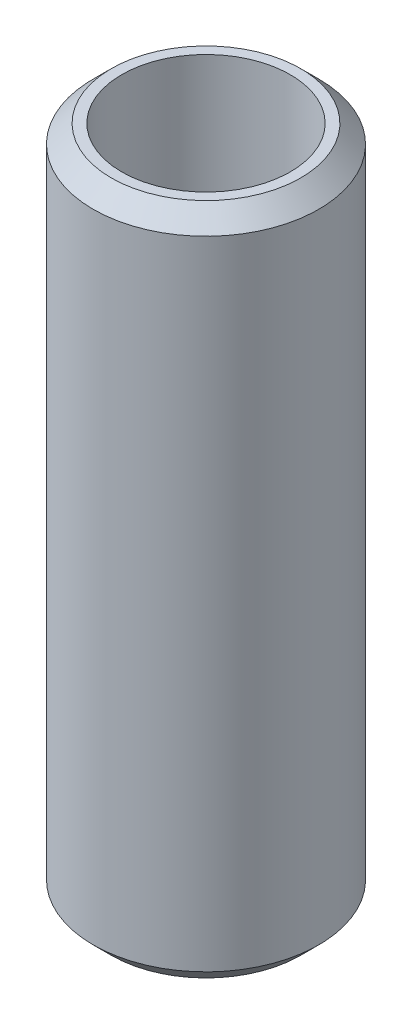
ISO-10303-21;
HEADER;
FILE_DESCRIPTION(('STEP AP214'),'2;1');
FILE_NAME('part.step','',(''),(''),'','','');
FILE_SCHEMA(('AUTOMOTIVE_DESIGN { 1 0 10303 214 1 1 1 1 }'));
ENDSEC;
DATA;
#1=APPLICATION_CONTEXT('core data for automotive mechanical design processes');
#2=APPLICATION_PROTOCOL_DEFINITION('international standard','automotive_design',2000,#1);
#3=PRODUCT_CONTEXT('',#1,'mechanical');
#4=PRODUCT('Part','Part','',(#3));
#5=PRODUCT_RELATED_PRODUCT_CATEGORY('part','',(#4));
#6=PRODUCT_DEFINITION_FORMATION('','',#4);
#7=PRODUCT_DEFINITION_CONTEXT('part definition',#1,'design');
#8=PRODUCT_DEFINITION('design','',#6,#7);
#9=PRODUCT_DEFINITION_SHAPE('','',#8);
#10=(LENGTH_UNIT() NAMED_UNIT(*) SI_UNIT(.MILLI.,.METRE.));
#11=(NAMED_UNIT(*) PLANE_ANGLE_UNIT() SI_UNIT($,.RADIAN.));
#12=(NAMED_UNIT(*) SI_UNIT($,.STERADIAN.) SOLID_ANGLE_UNIT());
#13=UNCERTAINTY_MEASURE_WITH_UNIT(LENGTH_MEASURE(1.E-05),#10,'distance_accuracy_value','');
#14=(GEOMETRIC_REPRESENTATION_CONTEXT(3) GLOBAL_UNCERTAINTY_ASSIGNED_CONTEXT((#13)) GLOBAL_UNIT_ASSIGNED_CONTEXT((#10,
#11,#12)) REPRESENTATION_CONTEXT('',''));
#15=CARTESIAN_POINT('',(0.,0.,0.));
#16=DIRECTION('',(0.,0.,1.));
#17=DIRECTION('',(1.,0.,0.));
#18=AXIS2_PLACEMENT_3D('',#15,#16,#17);
#19=CARTESIAN_POINT('',(0.,179.021406531786,0.));
#20=DIRECTION('',(0.,-1.,0.));
#21=DIRECTION('',(0.,0.,-1.));
#22=AXIS2_PLACEMENT_3D('',#19,#20,#21);
#23=CYLINDRICAL_SURFACE('',#22,30.);
#24=CARTESIAN_POINT('',(0.,174.208475685279,0.));
#25=DIRECTION('',(0.,1.,0.));
#26=DIRECTION('',(0.,0.,1.));
#27=AXIS2_PLACEMENT_3D('',#24,#25,#26);
#28=CIRCLE('',#27,30.);
#29=CARTESIAN_POINT('',(0.,174.208475685279,30.));
#30=VERTEX_POINT('',#29);
#31=EDGE_CURVE('E50',#30,#30,#28,.F.);
#32=ORIENTED_EDGE('',*,*,#31,.T.);
#33=EDGE_LOOP('',(#32));
#34=FACE_BOUND('',#33,.T.);
#35=CARTESIAN_POINT('',(0.,4.81293084650608,0.));
#36=DIRECTION('',(0.,1.,0.));
#37=DIRECTION('',(0.,0.,1.));
#38=AXIS2_PLACEMENT_3D('',#35,#36,#37);
#39=CIRCLE('',#38,30.);
#40=CARTESIAN_POINT('',(0.,4.81293084650608,30.));
#41=VERTEX_POINT('',#40);
#42=EDGE_CURVE('E51',#41,#41,#39,.T.);
#43=ORIENTED_EDGE('',*,*,#42,.T.);
#44=EDGE_LOOP('',(#43));
#45=FACE_BOUND('',#44,.T.);
#46=ADVANCED_FACE('F39',(#34,#45),#23,.T.);
#47=CARTESIAN_POINT('',(0.,179.021406531786,0.));
#48=DIRECTION('',(0.,1.,0.));
#49=DIRECTION('',(0.,0.,1.));
#50=AXIS2_PLACEMENT_3D('',#47,#48,#49);
#51=PLANE('',#50);
#52=CARTESIAN_POINT('',(0.,179.021406531786,0.));
#53=DIRECTION('',(0.,1.,0.));
#54=DIRECTION('',(0.,0.,1.));
#55=AXIS2_PLACEMENT_3D('',#52,#53,#54);
#56=CIRCLE('',#55,25.1870691534939);
#57=CARTESIAN_POINT('',(0.,179.021406531786,25.1870691534939));
#58=VERTEX_POINT('',#57);
#59=EDGE_CURVE('E54',#58,#58,#56,.T.);
#60=ORIENTED_EDGE('',*,*,#59,.T.);
#61=EDGE_LOOP('',(#60));
#62=FACE_BOUND('',#61,.T.);
#63=CARTESIAN_POINT('',(0.,179.021406531786,0.));
#64=DIRECTION('',(0.,1.,0.));
#65=DIRECTION('',(0.,0.,1.));
#66=AXIS2_PLACEMENT_3D('',#63,#64,#65);
#67=CIRCLE('',#66,22.4140823415501);
#68=CARTESIAN_POINT('',(0.,179.021406531786,22.4140823415501));
#69=VERTEX_POINT('',#68);
#70=EDGE_CURVE('E58',#69,#69,#67,.T.);
#71=ORIENTED_EDGE('',*,*,#70,.F.);
#72=EDGE_LOOP('',(#71));
#73=FACE_BOUND('',#72,.T.);
#74=ADVANCED_FACE('F69',(#62,#73),#51,.T.);
#75=CARTESIAN_POINT('',(0.,0.,0.));
#76=DIRECTION('',(0.,1.,0.));
#77=DIRECTION('',(0.,0.,1.));
#78=AXIS2_PLACEMENT_3D('',#75,#76,#77);
#79=PLANE('',#78);
#80=CARTESIAN_POINT('',(0.,0.,0.));
#81=DIRECTION('',(0.,1.,0.));
#82=DIRECTION('',(0.,0.,1.));
#83=AXIS2_PLACEMENT_3D('',#80,#81,#82);
#84=CIRCLE('',#83,25.1870691534939);
#85=CARTESIAN_POINT('',(0.,0.,25.1870691534939));
#86=VERTEX_POINT('',#85);
#87=EDGE_CURVE('E10',#86,#86,#84,.F.);
#88=ORIENTED_EDGE('',*,*,#87,.T.);
#89=EDGE_LOOP('',(#88));
#90=FACE_BOUND('',#89,.T.);
#91=CARTESIAN_POINT('',(0.,0.,0.));
#92=DIRECTION('',(0.,1.,0.));
#93=DIRECTION('',(0.,0.,1.));
#94=AXIS2_PLACEMENT_3D('',#91,#92,#93);
#95=CIRCLE('',#94,22.4140823415501);
#96=CARTESIAN_POINT('',(0.,0.,22.4140823415501));
#97=VERTEX_POINT('',#96);
#98=EDGE_CURVE('E63',#97,#97,#95,.T.);
#99=ORIENTED_EDGE('',*,*,#98,.T.);
#100=EDGE_LOOP('',(#99));
#101=FACE_BOUND('',#100,.T.);
#102=ADVANCED_FACE('F75',(#90,#101),#79,.F.);
#103=CARTESIAN_POINT('',(0.,179.021406531786,0.));
#104=DIRECTION('',(0.,-1.,0.));
#105=DIRECTION('',(0.,0.,-1.));
#106=AXIS2_PLACEMENT_3D('',#103,#104,#105);
#107=CYLINDRICAL_SURFACE('',#106,22.4140823415501);
#108=ORIENTED_EDGE('',*,*,#70,.T.);
#109=EDGE_LOOP('',(#108));
#110=FACE_BOUND('',#109,.T.);
#111=ORIENTED_EDGE('',*,*,#98,.F.);
#112=EDGE_LOOP('',(#111));
#113=FACE_BOUND('',#112,.T.);
#114=ADVANCED_FACE('F70',(#110,#113),#107,.F.);
#115=CARTESIAN_POINT('',(0.,179.021406531786,0.));
#116=DIRECTION('',(0.,-1.,0.));
#117=DIRECTION('',(0.,0.,-1.));
#118=AXIS2_PLACEMENT_3D('',#115,#116,#117);
#119=CONICAL_SURFACE('',#118,25.1870691534939,0.785398163397446);
#120=ORIENTED_EDGE('',*,*,#31,.F.);
#121=EDGE_LOOP('',(#120));
#122=FACE_BOUND('',#121,.T.);
#123=ORIENTED_EDGE('',*,*,#59,.F.);
#124=EDGE_LOOP('',(#123));
#125=FACE_BOUND('',#124,.T.);
#126=ADVANCED_FACE('F81',(#122,#125),#119,.T.);
#127=CARTESIAN_POINT('',(0.,4.81293084650608,0.));
#128=DIRECTION('',(0.,1.,0.));
#129=DIRECTION('',(0.,0.,1.));
#130=AXIS2_PLACEMENT_3D('',#127,#128,#129);
#131=CONICAL_SURFACE('',#130,30.,0.785398163397451);
#132=ORIENTED_EDGE('',*,*,#87,.F.);
#133=EDGE_LOOP('',(#132));
#134=FACE_BOUND('',#133,.T.);
#135=ORIENTED_EDGE('',*,*,#42,.F.);
#136=EDGE_LOOP('',(#135));
#137=FACE_BOUND('',#136,.T.);
#138=ADVANCED_FACE('F45',(#134,#137),#131,.T.);
#139=CLOSED_SHELL('',(#46,#74,#102,#114,#126,#138));
#140=MANIFOLD_SOLID_BREP('B2',#139);
#141=ADVANCED_BREP_SHAPE_REPRESENTATION('',(#18,#140),#14);
#142=SHAPE_DEFINITION_REPRESENTATION(#9,#141);
ENDSEC;
END-ISO-10303-21;
